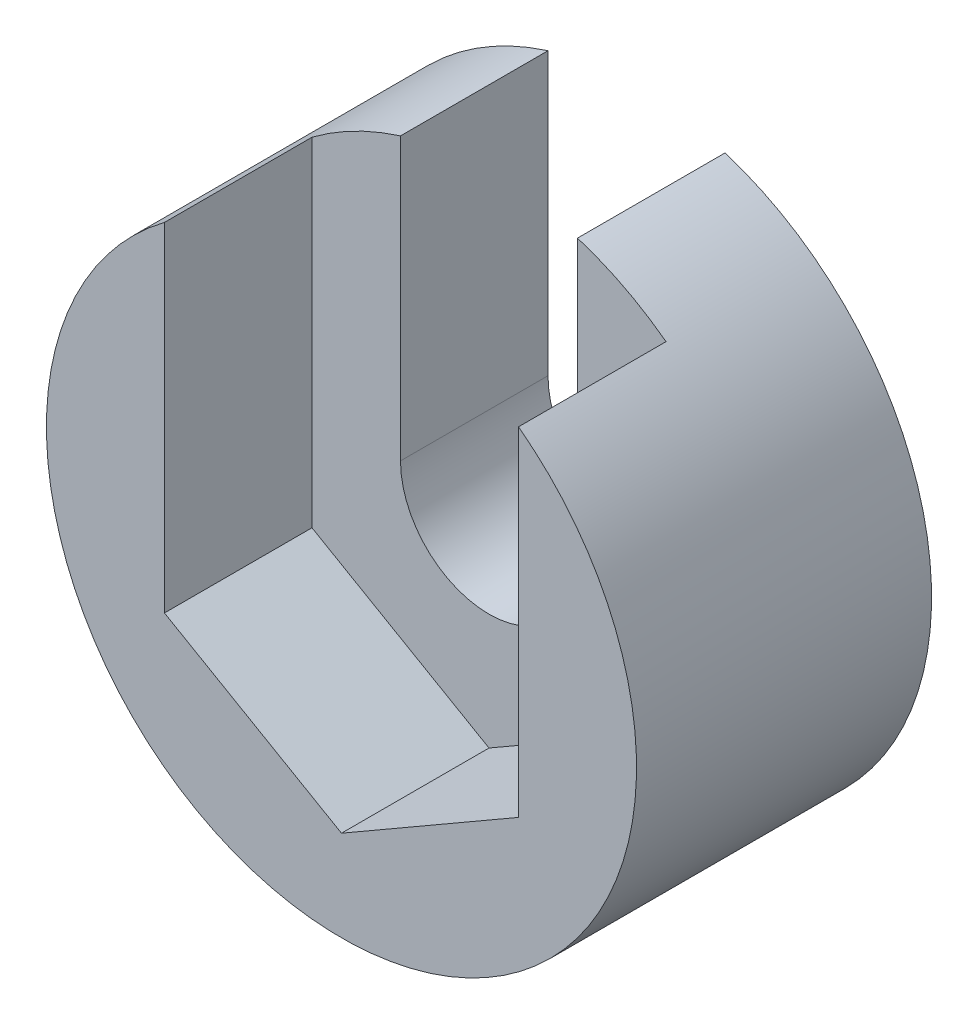
ISO-10303-21;
HEADER;
FILE_DESCRIPTION(('STEP AP214'),'2;1');
FILE_NAME('part.step','',(''),(''),'','','');
FILE_SCHEMA(('AUTOMOTIVE_DESIGN { 1 0 10303 214 1 1 1 1 }'));
ENDSEC;
DATA;
#1=APPLICATION_CONTEXT('core data for automotive mechanical design processes');
#2=APPLICATION_PROTOCOL_DEFINITION('international standard','automotive_design',2000,#1);
#3=PRODUCT_CONTEXT('',#1,'mechanical');
#4=PRODUCT('Part','Part','',(#3));
#5=PRODUCT_RELATED_PRODUCT_CATEGORY('part','',(#4));
#6=PRODUCT_DEFINITION_FORMATION('','',#4);
#7=PRODUCT_DEFINITION_CONTEXT('part definition',#1,'design');
#8=PRODUCT_DEFINITION('design','',#6,#7);
#9=PRODUCT_DEFINITION_SHAPE('','',#8);
#10=(LENGTH_UNIT() NAMED_UNIT(*) SI_UNIT(.MILLI.,.METRE.));
#11=(NAMED_UNIT(*) PLANE_ANGLE_UNIT() SI_UNIT($,.RADIAN.));
#12=(NAMED_UNIT(*) SI_UNIT($,.STERADIAN.) SOLID_ANGLE_UNIT());
#13=UNCERTAINTY_MEASURE_WITH_UNIT(LENGTH_MEASURE(1.E-05),#10,'distance_accuracy_value','');
#14=(GEOMETRIC_REPRESENTATION_CONTEXT(3) GLOBAL_UNCERTAINTY_ASSIGNED_CONTEXT((#13)) GLOBAL_UNIT_ASSIGNED_CONTEXT((#10,
#11,#12)) REPRESENTATION_CONTEXT('',''));
#15=CARTESIAN_POINT('',(0.,0.,0.));
#16=DIRECTION('',(0.,0.,1.));
#17=DIRECTION('',(1.,0.,0.));
#18=AXIS2_PLACEMENT_3D('',#15,#16,#17);
#19=CARTESIAN_POINT('',(0.,0.,5.));
#20=DIRECTION('',(0.,0.,-1.));
#21=DIRECTION('',(-1.,0.,0.));
#22=AXIS2_PLACEMENT_3D('',#19,#20,#21);
#23=CYLINDRICAL_SURFACE('',#22,5.);
#24=CARTESIAN_POINT('',(0.,0.,0.));
#25=DIRECTION('',(0.,0.,1.));
#26=DIRECTION('',(1.,0.,0.));
#27=AXIS2_PLACEMENT_3D('',#24,#25,#26);
#28=CIRCLE('',#27,5.);
#29=CARTESIAN_POINT('',(-1.49999999999999,4.76969600708473,0.));
#30=VERTEX_POINT('',#29);
#31=CARTESIAN_POINT('',(1.49999999999999,4.76969600708473,0.));
#32=VERTEX_POINT('',#31);
#33=EDGE_CURVE('E43',#30,#32,#28,.T.);
#34=ORIENTED_EDGE('',*,*,#33,.T.);
#35=DIRECTION('',(0.,0.,-1.));
#36=VECTOR('',#35,1.);
#37=CARTESIAN_POINT('',(1.49999999999999,4.76969600708473,5.));
#38=LINE('',#37,#36);
#39=CARTESIAN_POINT('',(1.49999999999999,4.76969600708473,2.5));
#40=VERTEX_POINT('',#39);
#41=EDGE_CURVE('E160',#32,#40,#38,.F.);
#42=ORIENTED_EDGE('',*,*,#41,.T.);
#43=CARTESIAN_POINT('',(0.,0.,2.5));
#44=DIRECTION('',(0.,0.,-1.));
#45=DIRECTION('',(-1.,0.,0.));
#46=AXIS2_PLACEMENT_3D('',#43,#44,#45);
#47=CIRCLE('',#46,5.);
#48=CARTESIAN_POINT('',(3.,4.,2.5));
#49=VERTEX_POINT('',#48);
#50=EDGE_CURVE('E130',#40,#49,#47,.T.);
#51=ORIENTED_EDGE('',*,*,#50,.T.);
#52=DIRECTION('',(0.,0.,-1.));
#53=VECTOR('',#52,1.);
#54=CARTESIAN_POINT('',(3.,4.,5.));
#55=LINE('',#54,#53);
#56=CARTESIAN_POINT('',(3.,4.,5.));
#57=VERTEX_POINT('',#56);
#58=EDGE_CURVE('E166',#49,#57,#55,.F.);
#59=ORIENTED_EDGE('',*,*,#58,.T.);
#60=CARTESIAN_POINT('',(0.,0.,5.));
#61=DIRECTION('',(0.,0.,1.));
#62=DIRECTION('',(1.,0.,0.));
#63=AXIS2_PLACEMENT_3D('',#60,#61,#62);
#64=CIRCLE('',#63,5.);
#65=CARTESIAN_POINT('',(-3.,4.,5.));
#66=VERTEX_POINT('',#65);
#67=EDGE_CURVE('E11',#66,#57,#64,.T.);
#68=ORIENTED_EDGE('',*,*,#67,.F.);
#69=DIRECTION('',(0.,0.,-1.));
#70=VECTOR('',#69,1.);
#71=CARTESIAN_POINT('',(-3.,4.,5.));
#72=LINE('',#71,#70);
#73=CARTESIAN_POINT('',(-3.,4.,2.5));
#74=VERTEX_POINT('',#73);
#75=EDGE_CURVE('E171',#66,#74,#72,.T.);
#76=ORIENTED_EDGE('',*,*,#75,.T.);
#77=CARTESIAN_POINT('',(-1.49999999999999,4.76969600708473,2.5));
#78=VERTEX_POINT('',#77);
#79=EDGE_CURVE('E127',#74,#78,#47,.T.);
#80=ORIENTED_EDGE('',*,*,#79,.T.);
#81=DIRECTION('',(0.,0.,-1.));
#82=VECTOR('',#81,1.);
#83=CARTESIAN_POINT('',(-1.49999999999999,4.76969600708473,5.));
#84=LINE('',#83,#82);
#85=EDGE_CURVE('E162',#78,#30,#84,.T.);
#86=ORIENTED_EDGE('',*,*,#85,.T.);
#87=EDGE_LOOP('',(#34,#42,#51,#59,#68,#76,#80,#86));
#88=FACE_BOUND('',#87,.T.);
#89=ADVANCED_FACE('F35',(#88),#23,.T.);
#90=CARTESIAN_POINT('',(0.,0.,5.));
#91=DIRECTION('',(0.,0.,1.));
#92=DIRECTION('',(1.,0.,0.));
#93=AXIS2_PLACEMENT_3D('',#90,#91,#92);
#94=PLANE('',#93);
#95=DIRECTION('',(0.,-1.,0.));
#96=VECTOR('',#95,1.);
#97=CARTESIAN_POINT('',(-3.,1.73205080756888,5.));
#98=LINE('',#97,#96);
#99=CARTESIAN_POINT('',(-3.,-1.73205080756888,5.));
#100=VERTEX_POINT('',#99);
#101=EDGE_CURVE('E122',#66,#100,#98,.T.);
#102=ORIENTED_EDGE('',*,*,#101,.F.);
#103=ORIENTED_EDGE('',*,*,#67,.T.);
#104=DIRECTION('',(0.,1.,0.));
#105=VECTOR('',#104,1.);
#106=CARTESIAN_POINT('',(3.,-1.73205080756888,5.));
#107=LINE('',#106,#105);
#108=CARTESIAN_POINT('',(3.,-1.73205080756888,5.));
#109=VERTEX_POINT('',#108);
#110=EDGE_CURVE('E138',#109,#57,#107,.T.);
#111=ORIENTED_EDGE('',*,*,#110,.F.);
#112=DIRECTION('',(0.866025403784439,0.5,0.));
#113=VECTOR('',#112,1.);
#114=CARTESIAN_POINT('',(0.,-3.46410161513776,5.));
#115=LINE('',#114,#113);
#116=CARTESIAN_POINT('',(0.,-3.46410161513776,5.));
#117=VERTEX_POINT('',#116);
#118=EDGE_CURVE('E150',#117,#109,#115,.T.);
#119=ORIENTED_EDGE('',*,*,#118,.F.);
#120=DIRECTION('',(0.866025403784438,-0.5,0.));
#121=VECTOR('',#120,1.);
#122=CARTESIAN_POINT('',(-3.,-1.73205080756888,5.));
#123=LINE('',#122,#121);
#124=EDGE_CURVE('E125',#100,#117,#123,.T.);
#125=ORIENTED_EDGE('',*,*,#124,.F.);
#126=EDGE_LOOP('',(#102,#103,#111,#119,#125));
#127=FACE_BOUND('',#126,.T.);
#128=ADVANCED_FACE('F185',(#127),#94,.T.);
#129=CARTESIAN_POINT('',(0.,0.,0.));
#130=DIRECTION('',(0.,0.,1.));
#131=DIRECTION('',(1.,0.,0.));
#132=AXIS2_PLACEMENT_3D('',#129,#130,#131);
#133=PLANE('',#132);
#134=CARTESIAN_POINT('',(0.,0.,0.));
#135=DIRECTION('',(0.,0.,1.));
#136=DIRECTION('',(1.,0.,0.));
#137=AXIS2_PLACEMENT_3D('',#134,#135,#136);
#138=CIRCLE('',#137,1.49999999999999);
#139=CARTESIAN_POINT('',(-1.49999999999999,0.,0.));
#140=VERTEX_POINT('',#139);
#141=CARTESIAN_POINT('',(1.49999999999999,0.,0.));
#142=VERTEX_POINT('',#141);
#143=EDGE_CURVE('E38',#140,#142,#138,.T.);
#144=ORIENTED_EDGE('',*,*,#143,.T.);
#145=DIRECTION('',(0.,1.,0.));
#146=VECTOR('',#145,1.);
#147=CARTESIAN_POINT('',(1.49999999999999,0.,0.));
#148=LINE('',#147,#146);
#149=EDGE_CURVE('E51',#142,#32,#148,.T.);
#150=ORIENTED_EDGE('',*,*,#149,.T.);
#151=ORIENTED_EDGE('',*,*,#33,.F.);
#152=DIRECTION('',(0.,-1.,0.));
#153=VECTOR('',#152,1.);
#154=CARTESIAN_POINT('',(-1.49999999999999,0.,0.));
#155=LINE('',#154,#153);
#156=EDGE_CURVE('E107',#30,#140,#155,.T.);
#157=ORIENTED_EDGE('',*,*,#156,.T.);
#158=EDGE_LOOP('',(#144,#150,#151,#157));
#159=FACE_BOUND('',#158,.T.);
#160=ADVANCED_FACE('F118',(#159),#133,.F.);
#161=CARTESIAN_POINT('',(3.,-1.73205080756888,2.5));
#162=DIRECTION('',(1.,0.,0.));
#163=DIRECTION('',(0.,1.,0.));
#164=AXIS2_PLACEMENT_3D('',#161,#162,#163);
#165=PLANE('',#164);
#166=ORIENTED_EDGE('',*,*,#110,.T.);
#167=ORIENTED_EDGE('',*,*,#58,.F.);
#168=DIRECTION('',(0.,1.,0.));
#169=VECTOR('',#168,1.);
#170=CARTESIAN_POINT('',(3.,-1.73205080756888,2.5));
#171=LINE('',#170,#169);
#172=CARTESIAN_POINT('',(3.,-1.73205080756888,2.5));
#173=VERTEX_POINT('',#172);
#174=EDGE_CURVE('E144',#173,#49,#171,.T.);
#175=ORIENTED_EDGE('',*,*,#174,.F.);
#176=DIRECTION('',(0.,0.,1.));
#177=VECTOR('',#176,1.);
#178=CARTESIAN_POINT('',(3.,-1.73205080756888,2.5));
#179=LINE('',#178,#177);
#180=EDGE_CURVE('E154',#173,#109,#179,.T.);
#181=ORIENTED_EDGE('',*,*,#180,.T.);
#182=EDGE_LOOP('',(#166,#167,#175,#181));
#183=FACE_BOUND('',#182,.T.);
#184=ADVANCED_FACE('F181',(#183),#165,.F.);
#185=CARTESIAN_POINT('',(0.,-3.46410161513776,2.5));
#186=DIRECTION('',(0.5,-0.866025403784439,0.));
#187=DIRECTION('',(0.866025403784439,0.5,0.));
#188=AXIS2_PLACEMENT_3D('',#185,#186,#187);
#189=PLANE('',#188);
#190=ORIENTED_EDGE('',*,*,#118,.T.);
#191=ORIENTED_EDGE('',*,*,#180,.F.);
#192=DIRECTION('',(0.866025403784439,0.5,0.));
#193=VECTOR('',#192,1.);
#194=CARTESIAN_POINT('',(0.,-3.46410161513776,2.5));
#195=LINE('',#194,#193);
#196=CARTESIAN_POINT('',(0.,-3.46410161513776,2.5));
#197=VERTEX_POINT('',#196);
#198=EDGE_CURVE('E141',#197,#173,#195,.T.);
#199=ORIENTED_EDGE('',*,*,#198,.F.);
#200=DIRECTION('',(0.,0.,1.));
#201=VECTOR('',#200,1.);
#202=CARTESIAN_POINT('',(0.,-3.46410161513776,2.5));
#203=LINE('',#202,#201);
#204=EDGE_CURVE('E156',#197,#117,#203,.T.);
#205=ORIENTED_EDGE('',*,*,#204,.T.);
#206=EDGE_LOOP('',(#190,#191,#199,#205));
#207=FACE_BOUND('',#206,.T.);
#208=ADVANCED_FACE('F216',(#207),#189,.F.);
#209=CARTESIAN_POINT('',(-3.,-1.73205080756888,2.5));
#210=DIRECTION('',(-0.5,-0.866025403784439,0.));
#211=DIRECTION('',(0.866025403784439,-0.5,0.));
#212=AXIS2_PLACEMENT_3D('',#209,#210,#211);
#213=PLANE('',#212);
#214=ORIENTED_EDGE('',*,*,#124,.T.);
#215=ORIENTED_EDGE('',*,*,#204,.F.);
#216=DIRECTION('',(0.866025403784438,-0.5,0.));
#217=VECTOR('',#216,1.);
#218=CARTESIAN_POINT('',(-3.,-1.73205080756888,2.5));
#219=LINE('',#218,#217);
#220=CARTESIAN_POINT('',(-3.,-1.73205080756888,2.5));
#221=VERTEX_POINT('',#220);
#222=EDGE_CURVE('E137',#221,#197,#219,.T.);
#223=ORIENTED_EDGE('',*,*,#222,.F.);
#224=DIRECTION('',(0.,0.,1.));
#225=VECTOR('',#224,1.);
#226=CARTESIAN_POINT('',(-3.,-1.73205080756888,2.5));
#227=LINE('',#226,#225);
#228=EDGE_CURVE('E146',#221,#100,#227,.T.);
#229=ORIENTED_EDGE('',*,*,#228,.T.);
#230=EDGE_LOOP('',(#214,#215,#223,#229));
#231=FACE_BOUND('',#230,.T.);
#232=ADVANCED_FACE('F213',(#231),#213,.F.);
#233=CARTESIAN_POINT('',(-3.,1.73205080756888,2.5));
#234=DIRECTION('',(-1.,0.,0.));
#235=DIRECTION('',(0.,0.,1.));
#236=AXIS2_PLACEMENT_3D('',#233,#234,#235);
#237=PLANE('',#236);
#238=ORIENTED_EDGE('',*,*,#101,.T.);
#239=ORIENTED_EDGE('',*,*,#228,.F.);
#240=DIRECTION('',(0.,-1.,0.));
#241=VECTOR('',#240,1.);
#242=CARTESIAN_POINT('',(-3.,1.73205080756888,2.5));
#243=LINE('',#242,#241);
#244=EDGE_CURVE('E134',#74,#221,#243,.T.);
#245=ORIENTED_EDGE('',*,*,#244,.F.);
#246=ORIENTED_EDGE('',*,*,#75,.F.);
#247=EDGE_LOOP('',(#238,#239,#245,#246));
#248=FACE_BOUND('',#247,.T.);
#249=ADVANCED_FACE('F188',(#248),#237,.F.);
#250=CARTESIAN_POINT('',(0.,0.,2.5));
#251=DIRECTION('',(0.,0.,1.));
#252=DIRECTION('',(1.,0.,0.));
#253=AXIS2_PLACEMENT_3D('',#250,#251,#252);
#254=PLANE('',#253);
#255=DIRECTION('',(0.,1.,0.));
#256=VECTOR('',#255,1.);
#257=CARTESIAN_POINT('',(1.49999999999999,0.,2.5));
#258=LINE('',#257,#256);
#259=CARTESIAN_POINT('',(1.49999999999999,0.,2.5));
#260=VERTEX_POINT('',#259);
#261=EDGE_CURVE('E190',#260,#40,#258,.T.);
#262=ORIENTED_EDGE('',*,*,#261,.F.);
#263=CARTESIAN_POINT('',(0.,0.,2.5));
#264=DIRECTION('',(0.,0.,1.));
#265=DIRECTION('',(1.,0.,0.));
#266=AXIS2_PLACEMENT_3D('',#263,#264,#265);
#267=CIRCLE('',#266,1.49999999999999);
#268=CARTESIAN_POINT('',(-1.49999999999999,0.,2.5));
#269=VERTEX_POINT('',#268);
#270=EDGE_CURVE('E123',#269,#260,#267,.T.);
#271=ORIENTED_EDGE('',*,*,#270,.F.);
#272=DIRECTION('',(0.,-1.,0.));
#273=VECTOR('',#272,1.);
#274=CARTESIAN_POINT('',(-1.49999999999999,0.,2.5));
#275=LINE('',#274,#273);
#276=EDGE_CURVE('E59',#78,#269,#275,.T.);
#277=ORIENTED_EDGE('',*,*,#276,.F.);
#278=ORIENTED_EDGE('',*,*,#79,.F.);
#279=ORIENTED_EDGE('',*,*,#244,.T.);
#280=ORIENTED_EDGE('',*,*,#222,.T.);
#281=ORIENTED_EDGE('',*,*,#198,.T.);
#282=ORIENTED_EDGE('',*,*,#174,.T.);
#283=ORIENTED_EDGE('',*,*,#50,.F.);
#284=EDGE_LOOP('',(#262,#271,#277,#278,#279,#280,#281,#282,#283));
#285=FACE_BOUND('',#284,.T.);
#286=ADVANCED_FACE('F178',(#285),#254,.T.);
#287=CARTESIAN_POINT('',(0.,0.,2.5));
#288=DIRECTION('',(0.,0.,1.));
#289=DIRECTION('',(1.,0.,0.));
#290=AXIS2_PLACEMENT_3D('',#287,#288,#289);
#291=CYLINDRICAL_SURFACE('',#290,1.49999999999999);
#292=ORIENTED_EDGE('',*,*,#270,.T.);
#293=DIRECTION('',(0.,0.,1.));
#294=VECTOR('',#293,1.);
#295=CARTESIAN_POINT('',(1.49999999999999,0.,0.));
#296=LINE('',#295,#294);
#297=EDGE_CURVE('E113',#142,#260,#296,.T.);
#298=ORIENTED_EDGE('',*,*,#297,.F.);
#299=ORIENTED_EDGE('',*,*,#143,.F.);
#300=DIRECTION('',(0.,0.,1.));
#301=VECTOR('',#300,1.);
#302=CARTESIAN_POINT('',(-1.49999999999999,0.,0.));
#303=LINE('',#302,#301);
#304=EDGE_CURVE('E104',#140,#269,#303,.T.);
#305=ORIENTED_EDGE('',*,*,#304,.T.);
#306=EDGE_LOOP('',(#292,#298,#299,#305));
#307=FACE_BOUND('',#306,.T.);
#308=ADVANCED_FACE('F121',(#307),#291,.F.);
#309=CARTESIAN_POINT('',(-1.49999999999999,0.,0.));
#310=DIRECTION('',(-1.,0.,0.));
#311=DIRECTION('',(0.,0.,1.));
#312=AXIS2_PLACEMENT_3D('',#309,#310,#311);
#313=PLANE('',#312);
#314=ORIENTED_EDGE('',*,*,#276,.T.);
#315=ORIENTED_EDGE('',*,*,#304,.F.);
#316=ORIENTED_EDGE('',*,*,#156,.F.);
#317=ORIENTED_EDGE('',*,*,#85,.F.);
#318=EDGE_LOOP('',(#314,#315,#316,#317));
#319=FACE_BOUND('',#318,.T.);
#320=ADVANCED_FACE('F106',(#319),#313,.F.);
#321=CARTESIAN_POINT('',(1.49999999999999,0.,0.));
#322=DIRECTION('',(1.,0.,0.));
#323=DIRECTION('',(0.,0.,-1.));
#324=AXIS2_PLACEMENT_3D('',#321,#322,#323);
#325=PLANE('',#324);
#326=ORIENTED_EDGE('',*,*,#149,.F.);
#327=ORIENTED_EDGE('',*,*,#297,.T.);
#328=ORIENTED_EDGE('',*,*,#261,.T.);
#329=ORIENTED_EDGE('',*,*,#41,.F.);
#330=EDGE_LOOP('',(#326,#327,#328,#329));
#331=FACE_BOUND('',#330,.T.);
#332=ADVANCED_FACE('F194',(#331),#325,.F.);
#333=CLOSED_SHELL('',(#89,#128,#160,#184,#208,#232,#249,#286,#308,#320,#332));
#334=MANIFOLD_SOLID_BREP('B2',#333);
#335=ADVANCED_BREP_SHAPE_REPRESENTATION('',(#18,#334),#14);
#336=SHAPE_DEFINITION_REPRESENTATION(#9,#335);
ENDSEC;
END-ISO-10303-21;
